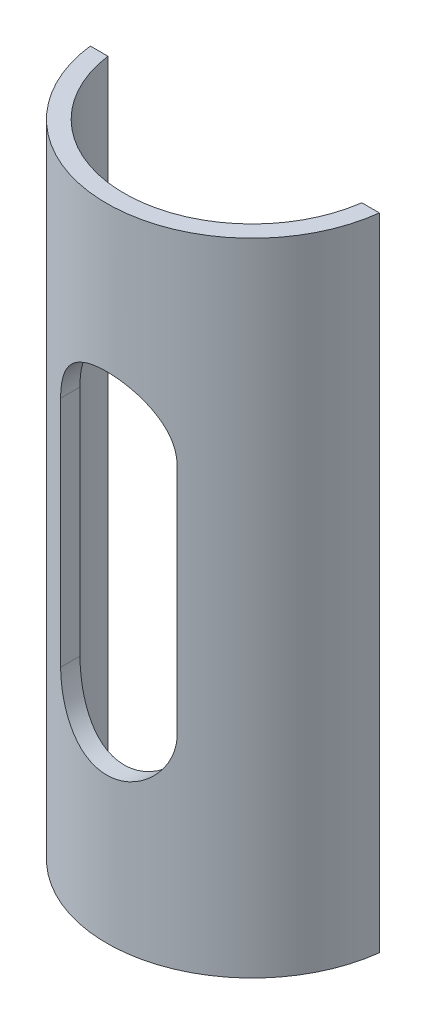
ISO-10303-21;
HEADER;
FILE_DESCRIPTION(('STEP AP214'),'2;1');
FILE_NAME('part.step','',(''),(''),'','','');
FILE_SCHEMA(('AUTOMOTIVE_DESIGN { 1 0 10303 214 1 1 1 1 }'));
ENDSEC;
DATA;
#1=APPLICATION_CONTEXT('core data for automotive mechanical design processes');
#2=APPLICATION_PROTOCOL_DEFINITION('international standard','automotive_design',2000,#1);
#3=PRODUCT_CONTEXT('',#1,'mechanical');
#4=PRODUCT('Part','Part','',(#3));
#5=PRODUCT_RELATED_PRODUCT_CATEGORY('part','',(#4));
#6=PRODUCT_DEFINITION_FORMATION('','',#4);
#7=PRODUCT_DEFINITION_CONTEXT('part definition',#1,'design');
#8=PRODUCT_DEFINITION('design','',#6,#7);
#9=PRODUCT_DEFINITION_SHAPE('','',#8);
#10=(LENGTH_UNIT() NAMED_UNIT(*) SI_UNIT(.MILLI.,.METRE.));
#11=(NAMED_UNIT(*) PLANE_ANGLE_UNIT() SI_UNIT($,.RADIAN.));
#12=(NAMED_UNIT(*) SI_UNIT($,.STERADIAN.) SOLID_ANGLE_UNIT());
#13=UNCERTAINTY_MEASURE_WITH_UNIT(LENGTH_MEASURE(1.E-05),#10,'distance_accuracy_value','');
#14=(GEOMETRIC_REPRESENTATION_CONTEXT(3) GLOBAL_UNCERTAINTY_ASSIGNED_CONTEXT((#13)) GLOBAL_UNIT_ASSIGNED_CONTEXT((#10,
#11,#12)) REPRESENTATION_CONTEXT('',''));
#15=CARTESIAN_POINT('',(0.,0.,0.));
#16=DIRECTION('',(0.,0.,1.));
#17=DIRECTION('',(1.,0.,0.));
#18=AXIS2_PLACEMENT_3D('',#15,#16,#17);
#19=CARTESIAN_POINT('',(0.,55.,0.));
#20=DIRECTION('',(0.,-1.,0.));
#21=DIRECTION('',(0.,0.,-1.));
#22=AXIS2_PLACEMENT_3D('',#19,#20,#21);
#23=CYLINDRICAL_SURFACE('',#22,25.);
#24=CARTESIAN_POINT('',(0.,-55.,0.));
#25=DIRECTION('',(0.,1.,0.));
#26=DIRECTION('',(0.,0.,1.));
#27=AXIS2_PLACEMENT_3D('',#24,#25,#26);
#28=CIRCLE('',#27,25.);
#29=CARTESIAN_POINT('',(-24.8193472919817,-55.,2.99999999999989));
#30=VERTEX_POINT('',#29);
#31=CARTESIAN_POINT('',(24.8193472919817,-55.,3.));
#32=VERTEX_POINT('',#31);
#33=EDGE_CURVE('E165',#30,#32,#28,.T.);
#34=ORIENTED_EDGE('',*,*,#33,.T.);
#35=DIRECTION('',(0.,-1.,0.));
#36=VECTOR('',#35,1.);
#37=CARTESIAN_POINT('',(24.8193472919817,55.,3.));
#38=LINE('',#37,#36);
#39=CARTESIAN_POINT('',(24.8193472919817,55.,3.));
#40=VERTEX_POINT('',#39);
#41=EDGE_CURVE('E168',#40,#32,#38,.T.);
#42=ORIENTED_EDGE('',*,*,#41,.F.);
#43=CARTESIAN_POINT('',(0.,55.,0.));
#44=DIRECTION('',(0.,1.,0.));
#45=DIRECTION('',(0.,0.,1.));
#46=AXIS2_PLACEMENT_3D('',#43,#44,#45);
#47=CIRCLE('',#46,25.);
#48=CARTESIAN_POINT('',(-24.8193472919817,55.,3.));
#49=VERTEX_POINT('',#48);
#50=EDGE_CURVE('E188',#49,#40,#47,.T.);
#51=ORIENTED_EDGE('',*,*,#50,.F.);
#52=DIRECTION('',(0.,-1.,0.));
#53=VECTOR('',#52,1.);
#54=CARTESIAN_POINT('',(-24.8193472919817,55.,3.));
#55=LINE('',#54,#53);
#56=EDGE_CURVE('E170',#49,#30,#55,.T.);
#57=ORIENTED_EDGE('',*,*,#56,.T.);
#58=EDGE_LOOP('',(#34,#42,#51,#57));
#59=FACE_BOUND('',#58,.T.);
#60=CARTESIAN_POINT('',(10.,20.,22.9128784747793));
#61=CARTESIAN_POINT('',(10.0000425292212,20.2690245809977,22.9128218191559));
#62=CARTESIAN_POINT('',(9.98914588174282,20.5380259875444,22.9176145998778));
#63=CARTESIAN_POINT('',(9.94579398570034,21.0738588308298,22.9364819687782));
#64=CARTESIAN_POINT('',(9.91334694801605,21.340691054866,22.9505530218423));
#65=CARTESIAN_POINT('',(9.82738279892872,21.8692294480735,22.9874877521144));
#66=CARTESIAN_POINT('',(9.77394897823352,22.130951639196,23.0103166635897));
#67=CARTESIAN_POINT('',(9.64657237176358,22.6485201405896,23.0640075374184));
#68=CARTESIAN_POINT('',(9.57262833409009,22.9043660911553,23.0948699901146));
#69=CARTESIAN_POINT('',(9.40504471753212,23.4081552469142,23.163620318281));
#70=CARTESIAN_POINT('',(9.31143143100467,23.6561084980248,23.2014988073202));
#71=CARTESIAN_POINT('',(9.10521302674763,24.1430713902433,23.2831998248359));
#72=CARTESIAN_POINT('',(8.99260079382725,24.3820776395322,23.3270245790071));
#73=CARTESIAN_POINT('',(8.74918387125798,24.8498818996507,23.4194092624398));
#74=CARTESIAN_POINT('',(8.61836707465125,25.0786729820151,23.4679723364472));
#75=CARTESIAN_POINT('',(8.33947502508424,25.5247034293787,23.5685197874819));
#76=CARTESIAN_POINT('',(8.19139844343112,25.7419419031577,23.6205044277739));
#77=CARTESIAN_POINT('',(7.87086270262005,26.1745990400814,23.7292985045449));
#78=CARTESIAN_POINT('',(7.69754224009253,26.3893521995864,23.7862186362439));
#79=CARTESIAN_POINT('',(7.33387378202605,26.8036964386267,23.9008501808953));
#80=CARTESIAN_POINT('',(7.14352533784404,27.0032871184137,23.9585616146627));
#81=CARTESIAN_POINT('',(6.74684075907606,27.3862135572747,24.0732791755033));
#82=CARTESIAN_POINT('',(6.54050114821435,27.5695457632852,24.1302851460768));
#83=CARTESIAN_POINT('',(6.1130211003301,27.9187845116563,24.2421075455041));
#84=CARTESIAN_POINT('',(5.89188112636743,28.0846915987808,24.2969240427745));
#85=CARTESIAN_POINT('',(5.42692751085174,28.4042347427254,24.4050744454916));
#86=CARTESIAN_POINT('',(5.18256142515063,28.5571179621335,24.4582621342832));
#87=CARTESIAN_POINT('',(4.68078518183313,28.8415714634338,24.5592285576283));
#88=CARTESIAN_POINT('',(4.42338037412804,28.9731503951586,24.6070094850162));
#89=CARTESIAN_POINT('',(3.89718830978044,29.2138817098203,24.6958112956283));
#90=CARTESIAN_POINT('',(3.62840227939798,29.3230365014487,24.7368329048114));
#91=CARTESIAN_POINT('',(3.08138092491057,29.517844830195,24.8109098223256));
#92=CARTESIAN_POINT('',(2.80314620647427,29.6034998704827,24.8439656401748));
#93=CARTESIAN_POINT('',(2.25305259659716,29.7468244672518,24.8997278381028));
#94=CARTESIAN_POINT('',(1.98153708903728,29.8056480533544,24.9228577626315));
#95=CARTESIAN_POINT('',(1.43395974328178,29.9005535438335,24.9603496461691));
#96=CARTESIAN_POINT('',(1.1578980393189,29.9366361184388,24.9747118635817));
#97=CARTESIAN_POINT('',(0.603485865867567,29.985651068198,24.9942537727212));
#98=CARTESIAN_POINT('',(0.325136106239022,29.9985903699417,24.9994362118753));
#99=CARTESIAN_POINT('',(-0.231685040469908,30.0011913013373,25.0004764570388));
#100=CARTESIAN_POINT('',(-0.510156422931537,29.9908537491245,24.9963345907791));
#101=CARTESIAN_POINT('',(-1.04935303363585,29.9482579111776,24.9793412044512));
#102=CARTESIAN_POINT('',(-1.31019532583514,29.9172654711461,24.9669927456056));
#103=CARTESIAN_POINT('',(-1.82814376456491,29.8349705479487,24.9344183341833));
#104=CARTESIAN_POINT('',(-2.08525007734043,29.7836689713934,24.9141927332472));
#105=CARTESIAN_POINT('',(-2.59399595704992,29.661244413715,24.8663723155126));
#106=CARTESIAN_POINT('',(-2.84563541896429,29.5901210521725,24.838777357282));
#107=CARTESIAN_POINT('',(-3.34183597350712,29.4286906290986,24.7768975627267));
#108=CARTESIAN_POINT('',(-3.58639686633356,29.3383830266653,24.7426125377769));
#109=CARTESIAN_POINT('',(-4.07053474144036,29.1378561287021,24.6676233604634));
#110=CARTESIAN_POINT('',(-4.30998383149299,29.0273611297677,24.6268314667387));
#111=CARTESIAN_POINT('',(-4.77877429805137,28.7882072214097,24.5401744994366));
#112=CARTESIAN_POINT('',(-5.00811200221874,28.6595417828496,24.4943076035603));
#113=CARTESIAN_POINT('',(-5.45537201034554,28.3849735320653,24.398590678047));
#114=CARTESIAN_POINT('',(-5.67329331851291,28.2390692197862,24.3487403019066));
#115=CARTESIAN_POINT('',(-6.09659552601135,27.9309560303126,24.2462153683148));
#116=CARTESIAN_POINT('',(-6.30197550088903,27.7687459535055,24.1935406032068));
#117=CARTESIAN_POINT('',(-6.71219948480528,27.4178120142423,24.0830731073694));
#118=CARTESIAN_POINT('',(-6.91612433249887,27.2280468619223,24.0251713281883));
#119=CARTESIAN_POINT('',(-7.30740755514754,26.8322212948945,23.9090663380437));
#120=CARTESIAN_POINT('',(-7.49476530078337,26.6261602617328,23.8508631157185));
#121=CARTESIAN_POINT('',(-7.85189241580627,26.1988191512717,23.7356906252662));
#122=CARTESIAN_POINT('',(-8.02165335314953,25.9775318615768,23.6787219589608));
#123=CARTESIAN_POINT('',(-8.34239343919931,25.5210755574957,23.5676321076018));
#124=CARTESIAN_POINT('',(-8.49337340236286,25.2859071457318,23.5135107991281));
#125=CARTESIAN_POINT('',(-8.77960393146415,24.79597362151,23.4081715434099));
#126=CARTESIAN_POINT('',(-8.91426828859565,24.540837235855,23.3570840704983));
#127=CARTESIAN_POINT('',(-9.16138202537973,24.0190030514526,23.2612692437556));
#128=CARTESIAN_POINT('',(-9.27384095504852,23.7523102832693,23.2165391580957));
#129=CARTESIAN_POINT('',(-9.47540318672815,23.209431186121,23.1350071385293));
#130=CARTESIAN_POINT('',(-9.56453550922621,22.9332571415496,23.0981953637583));
#131=CARTESIAN_POINT('',(-9.71862079015616,22.3733315118827,23.03378793588));
#132=CARTESIAN_POINT('',(-9.78358458939865,22.0895833855089,23.0061881512999));
#133=CARTESIAN_POINT('',(-9.89048983630447,21.5063726713902,22.960438902214));
#134=CARTESIAN_POINT('',(-9.93152303785059,21.2067112997565,22.9426634565812));
#135=CARTESIAN_POINT('',(-9.9725885894604,20.7552083067592,22.9248264300805));
#136=CARTESIAN_POINT('',(-9.98286305832183,20.6043975524111,22.9203517890329));
#137=CARTESIAN_POINT('',(-9.99656932730846,20.3023998602726,22.9143761097152));
#138=CARTESIAN_POINT('',(-10.0000008141957,20.1512129055789,22.9128752075683));
#139=CARTESIAN_POINT('',(-10.,20.,22.9128784747793));
#140=B_SPLINE_CURVE_WITH_KNOTS('',3,(#60,#61,#62,#63,#64,#65,#66,#67,#68,#69,#70,#71,#72,#73,
#74,#75,#76,#77,#78,#79,#80,#81,#82,#83,#84,#85,#86,#87,#88,#89,#90,#91,#92,#93,#94,#95,#96,#97,
#98,#99,#100,#101,#102,#103,#104,#105,#106,#107,#108,#109,#110,#111,#112,#113,#114,#115,#116,
#117,#118,#119,#120,#121,#122,#123,#124,#125,#126,#127,#128,#129,#130,#131,#132,#133,#134,#135,
#136,#137,#138,#139),.UNSPECIFIED.,.F.,.F.,(4,2,2,2,2,2,2,2,2,2,2,2,2,2,2,2,2,2,2,2,2,2,2,2,2,2,
2,2,2,2,2,2,2,2,2,2,2,2,2,4),(0.,0.806774265545912,1.61324131951602,2.41653955635881,
3.21988683556147,4.02216701628774,4.82474832422576,5.62786596319637,6.43104546865525,
7.27544284011397,8.11986246580439,8.9644661752569,9.8090434718835,10.6872895185795,
11.5651780863052,12.4429723061729,13.3207103645275,14.1559576875845,14.9911803928714,
15.8261530810671,16.6610964220841,17.4490707357659,18.237009877822,19.0249641430297,
19.812940627647,20.6126153443737,21.4125781407159,22.2126105978147,23.0127019563174,
23.8652844903882,24.7178993968256,25.5709209890087,26.423905576093,27.301734000098,
28.1791840651048,29.0555372540353,29.9314968787354,30.8388407270199,31.2923609256799,
31.7459018837827),.UNSPECIFIED.);
#141=CARTESIAN_POINT('',(10.,20.,22.9128784747793));
#142=VERTEX_POINT('',#141);
#143=CARTESIAN_POINT('',(-10.,20.,22.9128784747793));
#144=VERTEX_POINT('',#143);
#145=EDGE_CURVE('E115',#142,#144,#140,.T.);
#146=ORIENTED_EDGE('',*,*,#145,.F.);
#147=DIRECTION('',(0.,-1.,0.));
#148=VECTOR('',#147,1.);
#149=CARTESIAN_POINT('',(10.,55.,22.9128784747793));
#150=LINE('',#149,#148);
#151=CARTESIAN_POINT('',(10.,-20.,22.9128784747793));
#152=VERTEX_POINT('',#151);
#153=EDGE_CURVE('E104',#152,#142,#150,.F.);
#154=ORIENTED_EDGE('',*,*,#153,.F.);
#155=CARTESIAN_POINT('',(-10.,-20.,22.9128784747793));
#156=CARTESIAN_POINT('',(-10.0000425292212,-20.2690245809977,22.912821819156));
#157=CARTESIAN_POINT('',(-9.98914588174281,-20.5380259875443,22.9176145998778));
#158=CARTESIAN_POINT('',(-9.94579398570032,-21.0738588308298,22.9364819687782));
#159=CARTESIAN_POINT('',(-9.91334694801604,-21.340691054866,22.9505530218423));
#160=CARTESIAN_POINT('',(-9.82738279892871,-21.8692294480735,22.9874877521144));
#161=CARTESIAN_POINT('',(-9.77394897823351,-22.130951639196,23.0103166635897));
#162=CARTESIAN_POINT('',(-9.64657237176357,-22.6485201405896,23.0640075374184));
#163=CARTESIAN_POINT('',(-9.57262833409009,-22.9043660911553,23.0948699901146));
#164=CARTESIAN_POINT('',(-9.40504471753211,-23.4081552469142,23.163620318281));
#165=CARTESIAN_POINT('',(-9.31143143100467,-23.6561084980248,23.2014988073203));
#166=CARTESIAN_POINT('',(-9.10521302674763,-24.1430713902433,23.2831998248359));
#167=CARTESIAN_POINT('',(-8.99260079382724,-24.3820776395322,23.3270245790071));
#168=CARTESIAN_POINT('',(-8.74918387125798,-24.8498818996507,23.4194092624398));
#169=CARTESIAN_POINT('',(-8.61836707465125,-25.0786729820151,23.4679723364472));
#170=CARTESIAN_POINT('',(-8.33947502508424,-25.5247034293787,23.5685197874819));
#171=CARTESIAN_POINT('',(-8.19139844343112,-25.7419419031577,23.6205044277739));
#172=CARTESIAN_POINT('',(-7.87086270262005,-26.1745990400814,23.7292985045449));
#173=CARTESIAN_POINT('',(-7.69754224009253,-26.3893521995864,23.7862186362439));
#174=CARTESIAN_POINT('',(-7.33387378202605,-26.8036964386267,23.9008501808953));
#175=CARTESIAN_POINT('',(-7.14352533784405,-27.0032871184137,23.9585616146627));
#176=CARTESIAN_POINT('',(-6.74684075907606,-27.3862135572747,24.0732791755033));
#177=CARTESIAN_POINT('',(-6.54050114821436,-27.5695457632852,24.1302851460768));
#178=CARTESIAN_POINT('',(-6.1130211003301,-27.9187845116563,24.2421075455041));
#179=CARTESIAN_POINT('',(-5.89188112636743,-28.0846915987808,24.2969240427745));
#180=CARTESIAN_POINT('',(-5.42692751085174,-28.4042347427254,24.4050744454916));
#181=CARTESIAN_POINT('',(-5.18256142515064,-28.5571179621335,24.4582621342832));
#182=CARTESIAN_POINT('',(-4.68078518183314,-28.8415714634338,24.5592285576283));
#183=CARTESIAN_POINT('',(-4.42338037412805,-28.9731503951586,24.6070094850162));
#184=CARTESIAN_POINT('',(-3.89718830978045,-29.2138817098204,24.6958112956283));
#185=CARTESIAN_POINT('',(-3.62840227939801,-29.3230365014487,24.7368329048115));
#186=CARTESIAN_POINT('',(-3.08138092491059,-29.517844830195,24.8109098223256));
#187=CARTESIAN_POINT('',(-2.80314620647427,-29.6034998704827,24.8439656401747));
#188=CARTESIAN_POINT('',(-2.25305259659717,-29.7468244672518,24.8997278381026));
#189=CARTESIAN_POINT('',(-1.98153708903729,-29.8056480533544,24.9228577626314));
#190=CARTESIAN_POINT('',(-1.4339597432818,-29.9005535438335,24.9603496461691));
#191=CARTESIAN_POINT('',(-1.15789803931892,-29.9366361184388,24.9747118635817));
#192=CARTESIAN_POINT('',(-0.603485865867582,-29.985651068198,24.9942537727212));
#193=CARTESIAN_POINT('',(-0.325136106239038,-29.9985903699417,24.9994362118753));
#194=CARTESIAN_POINT('',(0.231685040469891,-30.0011913013373,25.0004764570388));
#195=CARTESIAN_POINT('',(0.510156422931521,-29.9908537491245,24.9963345907791));
#196=CARTESIAN_POINT('',(1.04935303363583,-29.9482579111776,24.9793412044512));
#197=CARTESIAN_POINT('',(1.31019532583514,-29.9172654711461,24.9669927456056));
#198=CARTESIAN_POINT('',(1.82814376456491,-29.8349705479487,24.9344183341833));
#199=CARTESIAN_POINT('',(2.08525007734043,-29.7836689713935,24.9141927332472));
#200=CARTESIAN_POINT('',(2.59399595704991,-29.661244413715,24.8663723155126));
#201=CARTESIAN_POINT('',(2.84563541896429,-29.5901210521725,24.838777357282));
#202=CARTESIAN_POINT('',(3.34183597350712,-29.4286906290986,24.7768975627267));
#203=CARTESIAN_POINT('',(3.58639686633355,-29.3383830266654,24.742612537777));
#204=CARTESIAN_POINT('',(4.07053474144036,-29.1378561287021,24.6676233604634));
#205=CARTESIAN_POINT('',(4.309983831493,-29.0273611297678,24.6268314667387));
#206=CARTESIAN_POINT('',(4.77877429805138,-28.7882072214097,24.5401744994366));
#207=CARTESIAN_POINT('',(5.00811200221875,-28.6595417828497,24.4943076035603));
#208=CARTESIAN_POINT('',(5.45537201034555,-28.3849735320653,24.398590678047));
#209=CARTESIAN_POINT('',(5.67329331851293,-28.2390692197862,24.3487403019066));
#210=CARTESIAN_POINT('',(6.09659552601136,-27.9309560303126,24.2462153683148));
#211=CARTESIAN_POINT('',(6.30197550088903,-27.7687459535055,24.1935406032068));
#212=CARTESIAN_POINT('',(6.71219948480529,-27.4178120142423,24.0830731073694));
#213=CARTESIAN_POINT('',(6.91612433249889,-27.2280468619223,24.0251713281883));
#214=CARTESIAN_POINT('',(7.30740755514756,-26.8322212948945,23.9090663380437));
#215=CARTESIAN_POINT('',(7.4947653007834,-26.6261602617329,23.8508631157184));
#216=CARTESIAN_POINT('',(7.85189241580629,-26.1988191512717,23.7356906252662));
#217=CARTESIAN_POINT('',(8.02165335314956,-25.9775318615768,23.6787219589608));
#218=CARTESIAN_POINT('',(8.34239343919933,-25.5210755574957,23.5676321076018));
#219=CARTESIAN_POINT('',(8.49337340236286,-25.2859071457317,23.5135107991281));
#220=CARTESIAN_POINT('',(8.77960393146415,-24.79597362151,23.4081715434099));
#221=CARTESIAN_POINT('',(8.91426828859566,-24.540837235855,23.3570840704983));
#222=CARTESIAN_POINT('',(9.16138202537976,-24.0190030514526,23.2612692437556));
#223=CARTESIAN_POINT('',(9.27384095504855,-23.7523102832693,23.2165391580957));
#224=CARTESIAN_POINT('',(9.47540318672817,-23.209431186121,23.1350071385293));
#225=CARTESIAN_POINT('',(9.56453550922624,-22.9332571415496,23.0981953637582));
#226=CARTESIAN_POINT('',(9.71862079015618,-22.3733315118827,23.03378793588));
#227=CARTESIAN_POINT('',(9.78358458939865,-22.0895833855089,23.0061881512999));
#228=CARTESIAN_POINT('',(9.89048983630448,-21.5063726713902,22.960438902214));
#229=CARTESIAN_POINT('',(9.9315230378506,-21.2067112997565,22.9426634565812));
#230=CARTESIAN_POINT('',(9.97258858946041,-20.7552083067592,22.9248264300805));
#231=CARTESIAN_POINT('',(9.98286305832184,-20.604397552411,22.9203517890329));
#232=CARTESIAN_POINT('',(9.99656932730847,-20.3023998602726,22.9143761097152));
#233=CARTESIAN_POINT('',(10.0000008141957,-20.1512129055789,22.9128752075683));
#234=CARTESIAN_POINT('',(10.,-20.,22.9128784747793));
#235=B_SPLINE_CURVE_WITH_KNOTS('',3,(#155,#156,#157,#158,#159,#160,#161,#162,#163,#164,#165,
#166,#167,#168,#169,#170,#171,#172,#173,#174,#175,#176,#177,#178,#179,#180,#181,#182,#183,#184,
#185,#186,#187,#188,#189,#190,#191,#192,#193,#194,#195,#196,#197,#198,#199,#200,#201,#202,#203,
#204,#205,#206,#207,#208,#209,#210,#211,#212,#213,#214,#215,#216,#217,#218,#219,#220,#221,#222,
#223,#224,#225,#226,#227,#228,#229,#230,#231,#232,#233,#234),.UNSPECIFIED.,.F.,.F.,(4,2,2,2,2,2,
2,2,2,2,2,2,2,2,2,2,2,2,2,2,2,2,2,2,2,2,2,2,2,2,2,2,2,2,2,2,2,2,2,4),(0.,0.806774265545916,
1.61324131951603,2.41653955635882,3.21988683556148,4.02216701628775,4.82474832422577,
5.62786596319638,6.43104546865526,7.27544284011399,8.11986246580441,8.96446617525691,
9.80904347188353,10.6872895185795,11.5651780863052,12.4429723061729,13.3207103645275,
14.1559576875846,14.9911803928714,15.8261530810671,16.6610964220842,17.449070735766,
18.237009877822,19.0249641430297,19.812940627647,20.6126153443737,21.4125781407159,
22.2126105978147,23.0127019563174,23.8652844903882,24.7178993968256,25.5709209890087,
26.423905576093,27.301734000098,28.1791840651048,29.0555372540353,29.9314968787354,
30.8388407270199,31.29236092568,31.7459018837827),.UNSPECIFIED.);
#236=CARTESIAN_POINT('',(-10.,-20.,22.9128784747793));
#237=VERTEX_POINT('',#236);
#238=EDGE_CURVE('E109',#237,#152,#235,.T.);
#239=ORIENTED_EDGE('',*,*,#238,.F.);
#240=DIRECTION('',(0.,-1.,0.));
#241=VECTOR('',#240,1.);
#242=CARTESIAN_POINT('',(-10.,55.,22.9128784747793));
#243=LINE('',#242,#241);
#244=EDGE_CURVE('E120',#144,#237,#243,.T.);
#245=ORIENTED_EDGE('',*,*,#244,.F.);
#246=EDGE_LOOP('',(#146,#154,#239,#245));
#247=FACE_BOUND('',#246,.T.);
#248=ADVANCED_FACE('F37',(#59,#247),#23,.T.);
#249=CARTESIAN_POINT('',(0.,55.,0.));
#250=DIRECTION('',(0.,-1.,0.));
#251=DIRECTION('',(0.,0.,-1.));
#252=AXIS2_PLACEMENT_3D('',#249,#250,#251);
#253=CYLINDRICAL_SURFACE('',#252,22.);
#254=CARTESIAN_POINT('',(0.,-55.,0.));
#255=DIRECTION('',(0.,1.,0.));
#256=DIRECTION('',(0.,0.,1.));
#257=AXIS2_PLACEMENT_3D('',#254,#255,#256);
#258=CIRCLE('',#257,22.);
#259=CARTESIAN_POINT('',(-21.7944947177034,-55.,3.));
#260=VERTEX_POINT('',#259);
#261=CARTESIAN_POINT('',(21.7944947177034,-55.,3.));
#262=VERTEX_POINT('',#261);
#263=EDGE_CURVE('E124',#260,#262,#258,.T.);
#264=ORIENTED_EDGE('',*,*,#263,.F.);
#265=DIRECTION('',(0.,-1.,0.));
#266=VECTOR('',#265,1.);
#267=CARTESIAN_POINT('',(-21.7944947177034,55.,3.));
#268=LINE('',#267,#266);
#269=CARTESIAN_POINT('',(-21.7944947177034,55.,3.));
#270=VERTEX_POINT('',#269);
#271=EDGE_CURVE('E186',#270,#260,#268,.T.);
#272=ORIENTED_EDGE('',*,*,#271,.F.);
#273=CARTESIAN_POINT('',(0.,55.,0.));
#274=DIRECTION('',(0.,1.,0.));
#275=DIRECTION('',(0.,0.,1.));
#276=AXIS2_PLACEMENT_3D('',#273,#274,#275);
#277=CIRCLE('',#276,22.);
#278=CARTESIAN_POINT('',(21.7944947177034,55.,3.));
#279=VERTEX_POINT('',#278);
#280=EDGE_CURVE('E261',#270,#279,#277,.T.);
#281=ORIENTED_EDGE('',*,*,#280,.T.);
#282=DIRECTION('',(0.,-1.,0.));
#283=VECTOR('',#282,1.);
#284=CARTESIAN_POINT('',(21.7944947177034,55.,3.));
#285=LINE('',#284,#283);
#286=EDGE_CURVE('E184',#279,#262,#285,.T.);
#287=ORIENTED_EDGE('',*,*,#286,.T.);
#288=EDGE_LOOP('',(#264,#272,#281,#287));
#289=FACE_BOUND('',#288,.T.);
#290=DIRECTION('',(0.,-1.,0.));
#291=VECTOR('',#290,1.);
#292=CARTESIAN_POINT('',(10.,55.,19.5959179422655));
#293=LINE('',#292,#291);
#294=CARTESIAN_POINT('',(9.99999999999999,-20.,19.5959179422655));
#295=VERTEX_POINT('',#294);
#296=CARTESIAN_POINT('',(10.,20.,19.5959179422655));
#297=VERTEX_POINT('',#296);
#298=EDGE_CURVE('E182',#295,#297,#293,.F.);
#299=ORIENTED_EDGE('',*,*,#298,.T.);
#300=CARTESIAN_POINT('',(10.,20.,19.5959179422655));
#301=CARTESIAN_POINT('',(10.0000459546036,20.265351150792,19.5958501579271));
#302=CARTESIAN_POINT('',(9.98944048956426,20.5306722042692,19.6013054827576));
#303=CARTESIAN_POINT('',(9.9472760367848,21.0590870268256,19.6227602637924));
#304=CARTESIAN_POINT('',(9.91572745068307,21.3221818359343,19.6387544857048));
#305=CARTESIAN_POINT('',(9.83222883850739,21.8429758757271,19.6806837575955));
#306=CARTESIAN_POINT('',(9.78037870970117,22.1006951148795,19.7065701168339));
#307=CARTESIAN_POINT('',(9.65687681061796,22.6102599728371,19.7673845614929));
#308=CARTESIAN_POINT('',(9.58522330863176,22.8621050758882,19.802313437621));
#309=CARTESIAN_POINT('',(9.42299192937907,23.3578429723776,19.8800220980285));
#310=CARTESIAN_POINT('',(9.33244957357005,23.6017497129589,19.9227871279104));
#311=CARTESIAN_POINT('',(9.13316701581743,24.0807631586418,20.0149269274918));
#312=CARTESIAN_POINT('',(9.02441981434717,24.3158664362169,20.064304238061));
#313=CARTESIAN_POINT('',(8.67194683764928,25.0064330783397,20.2203730455085));
#314=CARTESIAN_POINT('',(8.40203254335049,25.4470235240632,20.3349798981406));
#315=CARTESIAN_POINT('',(7.77902158889675,26.3077490156207,20.5816902577711));
#316=CARTESIAN_POINT('',(7.42156690116851,26.7245417293399,20.7144514085254));
#317=CARTESIAN_POINT('',(6.83790834912878,27.301926321201,20.9113703898898));
#318=CARTESIAN_POINT('',(6.63530339493279,27.4865193073655,20.9766791045949));
#319=CARTESIAN_POINT('',(6.21521596801168,27.8387589007364,21.1049576525379));
#320=CARTESIAN_POINT('',(5.99773899649749,28.0064117179215,21.167928337464));
#321=CARTESIAN_POINT('',(5.5369149590269,28.3322534109118,21.2932529363992));
#322=CARTESIAN_POINT('',(5.2928055623392,28.4894479358438,21.3553914221303));
#323=CARTESIAN_POINT('',(4.79070702644916,28.7825749297812,21.4736031244429));
#324=CARTESIAN_POINT('',(4.53271725116231,28.9185064232662,21.5296760627086));
#325=CARTESIAN_POINT('',(4.00465909651419,29.167764754881,21.6341190122001));
#326=CARTESIAN_POINT('',(3.73459567608179,29.281100770957,21.6824921493542));
#327=CARTESIAN_POINT('',(3.18425483042314,29.4840133419992,21.7701200583618));
#328=CARTESIAN_POINT('',(2.90397827890621,29.5735919239558,21.8093756080948));
#329=CARTESIAN_POINT('',(2.3526634360978,29.7232481026871,21.8754961066349));
#330=CARTESIAN_POINT('',(2.08209321873766,29.7847834652514,21.9029673440243));
#331=CARTESIAN_POINT('',(1.53597025398664,29.8852347530504,21.9480259937422));
#332=CARTESIAN_POINT('',(1.26041769110292,29.9241515141396,21.9656137713062));
#333=CARTESIAN_POINT('',(0.70667137222669,29.9788774169754,21.9903933341728));
#334=CARTESIAN_POINT('',(0.428478706899332,29.9946957156773,21.9975892391274));
#335=CARTESIAN_POINT('',(-0.128322594867302,30.003051815217,22.0013869570268));
#336=CARTESIAN_POINT('',(-0.406931210731409,29.9955907317782,21.997989277696));
#337=CARTESIAN_POINT('',(-0.942134934340189,29.9588679837498,21.9813288065582));
#338=CARTESIAN_POINT('',(-1.19886558116072,29.9312210885402,21.9687968356934));
#339=CARTESIAN_POINT('',(-1.70884611017049,29.8562803383879,21.9350209108399));
#340=CARTESIAN_POINT('',(-1.96209619300757,29.8089876209387,21.913777461247));
#341=CARTESIAN_POINT('',(-2.46341367347811,29.695239162701,21.8630984259399));
#342=CARTESIAN_POINT('',(-2.7114809966753,29.6287831468863,21.8336627226531));
#343=CARTESIAN_POINT('',(-3.2008612349238,29.4773470038591,21.7673029700658));
#344=CARTESIAN_POINT('',(-3.44217392926491,29.3923662721395,21.7303786763969));
#345=CARTESIAN_POINT('',(-3.92017117178583,29.2032216084481,21.6492926784389));
#346=CARTESIAN_POINT('',(-4.15673331180365,29.0987908895765,21.6050313992418));
#347=CARTESIAN_POINT('',(-4.62018045345487,28.8724579485664,21.5106940942217));
#348=CARTESIAN_POINT('',(-4.84706196417536,28.7505494917656,21.4606159946365));
#349=CARTESIAN_POINT('',(-5.51133762454949,28.3599516405829,21.3033267089081));
#350=CARTESIAN_POINT('',(-5.93264680787961,28.0662765544342,21.1890103356963));
#351=CARTESIAN_POINT('',(-6.75626789623605,27.3931278423885,20.9416508900975));
#352=CARTESIAN_POINT('',(-7.15423614712878,27.0086136254421,20.8078409130539));
#353=CARTESIAN_POINT('',(-7.69986591918541,26.3865795192071,20.6094578252857));
#354=CARTESIAN_POINT('',(-7.8732930679616,26.1715230802391,20.5436731334649));
#355=CARTESIAN_POINT('',(-8.20214973173149,25.7272221804347,20.4146000086312));
#356=CARTESIAN_POINT('',(-8.35757686943435,25.4979758516375,20.3513119060731));
#357=CARTESIAN_POINT('',(-8.65605118093926,25.0156641103697,20.2262251857816));
#358=CARTESIAN_POINT('',(-8.79819732378045,24.7619878348007,20.1646297336199));
#359=CARTESIAN_POINT('',(-9.06032930087307,24.242068296829,20.0482168058435));
#360=CARTESIAN_POINT('',(-9.18032479398506,23.9758305757763,19.9933963794205));
#361=CARTESIAN_POINT('',(-9.39686269593619,23.4328201270531,19.8925423073307));
#362=CARTESIAN_POINT('',(-9.49344005233504,23.1560638195405,19.8464955906793));
#363=CARTESIAN_POINT('',(-9.6621980567623,22.5938517119205,19.7648857115154));
#364=CARTESIAN_POINT('',(-9.73438948122793,22.3083998154573,19.7293179191304));
#365=CARTESIAN_POINT('',(-9.86213379628529,21.6888593716363,19.6658137253755));
#366=CARTESIAN_POINT('',(-9.91373407522804,21.3537403858209,19.6397422918209));
#367=CARTESIAN_POINT('',(-9.96543564724799,20.8478863965485,19.6135262544712));
#368=CARTESIAN_POINT('',(-9.97838639107056,20.6786834976117,19.6069360497949));
#369=CARTESIAN_POINT('',(-9.9956708111632,20.3396675614707,19.5981278943323));
#370=CARTESIAN_POINT('',(-10.000001568335,20.1698543370799,19.595911424683));
#371=CARTESIAN_POINT('',(-10.,20.,19.5959179422655));
#372=B_SPLINE_CURVE_WITH_KNOTS('',3,(#300,#301,#302,#303,#304,#305,#306,#307,#308,#309,#310,
#311,#312,#313,#314,#315,#316,#317,#318,#319,#320,#321,#322,#323,#324,#325,#326,#327,#328,#329,
#330,#331,#332,#333,#334,#335,#336,#337,#338,#339,#340,#341,#342,#343,#344,#345,#346,#347,#348,
#349,#350,#351,#352,#353,#354,#355,#356,#357,#358,#359,#360,#361,#362,#363,#364,#365,#366,#367,
#368,#369,#370,#371),.UNSPECIFIED.,.F.,.F.,(4,2,2,2,2,2,2,2,2,2,2,2,2,2,2,2,2,2,2,2,2,2,2,2,2,2,
2,2,2,2,2,2,2,2,2,4),(0.,0.795738127972644,1.59108133897605,2.38255913955437,3.17410617294884,
3.9641778673464,4.75455403468665,6.33571655745986,8.02269777335702,8.86722863899357,
9.71144878209916,10.6010858142825,11.4907636499002,12.3800793720669,13.2693191931561,
14.1047201521591,14.9400902375392,15.7751290660064,16.6101278737324,17.3847713726812,
18.1593700260046,18.9339797966954,19.7086148485937,20.4947837654025,21.2812338255709,
22.8532150529717,24.5532577846281,25.4044825565146,26.2558196231457,27.1464033068017,
28.0365977265304,28.9254553927524,29.8139197466154,30.8317357607126,31.3409757355028,
31.8503881315315),.UNSPECIFIED.);
#373=CARTESIAN_POINT('',(-10.,20.,19.5959179422655));
#374=VERTEX_POINT('',#373);
#375=EDGE_CURVE('E11',#297,#374,#372,.T.);
#376=ORIENTED_EDGE('',*,*,#375,.T.);
#377=DIRECTION('',(0.,-1.,0.));
#378=VECTOR('',#377,1.);
#379=CARTESIAN_POINT('',(-10.,55.,19.5959179422655));
#380=LINE('',#379,#378);
#381=CARTESIAN_POINT('',(-9.99999999999999,-20.,19.5959179422655));
#382=VERTEX_POINT('',#381);
#383=EDGE_CURVE('E50',#374,#382,#380,.T.);
#384=ORIENTED_EDGE('',*,*,#383,.T.);
#385=CARTESIAN_POINT('',(-9.99999999999999,-20.,19.5959179422655));
#386=CARTESIAN_POINT('',(-10.0000459546035,-20.265351150792,19.5958501579271));
#387=CARTESIAN_POINT('',(-9.98944048956424,-20.5306722042692,19.6013054827576));
#388=CARTESIAN_POINT('',(-9.94727603678479,-21.0590870268256,19.6227602637924));
#389=CARTESIAN_POINT('',(-9.91572745068305,-21.3221818359343,19.6387544857048));
#390=CARTESIAN_POINT('',(-9.83222883850738,-21.8429758757271,19.6806837575956));
#391=CARTESIAN_POINT('',(-9.78037870970117,-22.1006951148795,19.7065701168339));
#392=CARTESIAN_POINT('',(-9.65687681061796,-22.6102599728371,19.7673845614929));
#393=CARTESIAN_POINT('',(-9.58522330863175,-22.8621050758882,19.8023134376209));
#394=CARTESIAN_POINT('',(-9.42299192937906,-23.3578429723776,19.8800220980284));
#395=CARTESIAN_POINT('',(-9.33244957357004,-23.6017497129589,19.9227871279103));
#396=CARTESIAN_POINT('',(-9.13316701581743,-24.0807631586418,20.0149269274919));
#397=CARTESIAN_POINT('',(-9.02441981434717,-24.3158664362169,20.064304238061));
#398=CARTESIAN_POINT('',(-8.67194683764928,-25.0064330783397,20.2203730455085));
#399=CARTESIAN_POINT('',(-8.40203254335049,-25.4470235240632,20.3349798981406));
#400=CARTESIAN_POINT('',(-7.77902158889675,-26.3077490156207,20.5816902577711));
#401=CARTESIAN_POINT('',(-7.42156690116852,-26.7245417293399,20.7144514085254));
#402=CARTESIAN_POINT('',(-6.8379083491288,-27.3019263212009,20.9113703898898));
#403=CARTESIAN_POINT('',(-6.63530339493282,-27.4865193073655,20.976679104595));
#404=CARTESIAN_POINT('',(-6.21521596801171,-27.8387589007364,21.1049576525379));
#405=CARTESIAN_POINT('',(-5.9977389964975,-28.0064117179215,21.1679283374639));
#406=CARTESIAN_POINT('',(-5.5369149590269,-28.3322534109118,21.2932529363991));
#407=CARTESIAN_POINT('',(-5.29280556233923,-28.4894479358438,21.3553914221302));
#408=CARTESIAN_POINT('',(-4.79070702644919,-28.7825749297812,21.473603124443));
#409=CARTESIAN_POINT('',(-4.53271725116235,-28.9185064232662,21.5296760627086));
#410=CARTESIAN_POINT('',(-4.00465909651422,-29.167764754881,21.6341190122001));
#411=CARTESIAN_POINT('',(-3.73459567608182,-29.2811007709571,21.6824921493542));
#412=CARTESIAN_POINT('',(-3.18425483042316,-29.4840133419992,21.7701200583618));
#413=CARTESIAN_POINT('',(-2.90397827890622,-29.5735919239558,21.8093756080947));
#414=CARTESIAN_POINT('',(-2.35266343609779,-29.7232481026871,21.8754961066348));
#415=CARTESIAN_POINT('',(-2.08209321873767,-29.7847834652514,21.9029673440243));
#416=CARTESIAN_POINT('',(-1.53597025398665,-29.8852347530504,21.9480259937422));
#417=CARTESIAN_POINT('',(-1.26041769110293,-29.9241515141396,21.9656137713062));
#418=CARTESIAN_POINT('',(-0.706671372226697,-29.9788774169754,21.9903933341728));
#419=CARTESIAN_POINT('',(-0.42847870689934,-29.9946957156773,21.9975892391274));
#420=CARTESIAN_POINT('',(0.128322594867295,-30.003051815217,22.0013869570268));
#421=CARTESIAN_POINT('',(0.406931210731405,-29.9955907317782,21.997989277696));
#422=CARTESIAN_POINT('',(0.942134934340188,-29.9588679837498,21.9813288065582));
#423=CARTESIAN_POINT('',(1.19886558116071,-29.9312210885402,21.9687968356934));
#424=CARTESIAN_POINT('',(1.70884611017048,-29.856280338388,21.9350209108399));
#425=CARTESIAN_POINT('',(1.96209619300756,-29.8089876209388,21.913777461247));
#426=CARTESIAN_POINT('',(2.46341367347809,-29.695239162701,21.8630984259399));
#427=CARTESIAN_POINT('',(2.71148099667528,-29.6287831468863,21.833662722653));
#428=CARTESIAN_POINT('',(3.20086123492378,-29.4773470038591,21.7673029700658));
#429=CARTESIAN_POINT('',(3.44217392926489,-29.3923662721395,21.7303786763971));
#430=CARTESIAN_POINT('',(3.92017117178581,-29.2032216084481,21.649292678439));
#431=CARTESIAN_POINT('',(4.15673331180364,-29.0987908895765,21.6050313992418));
#432=CARTESIAN_POINT('',(4.62018045345486,-28.8724579485664,21.5106940942216));
#433=CARTESIAN_POINT('',(4.84706196417536,-28.7505494917656,21.4606159946365));
#434=CARTESIAN_POINT('',(5.51133762454949,-28.359951640583,21.3033267089082));
#435=CARTESIAN_POINT('',(5.9326468078796,-28.0662765544342,21.1890103356963));
#436=CARTESIAN_POINT('',(6.75626789623604,-27.3931278423885,20.9416508900975));
#437=CARTESIAN_POINT('',(7.15423614712879,-27.0086136254422,20.8078409130539));
#438=CARTESIAN_POINT('',(7.69986591918544,-26.3865795192071,20.6094578252857));
#439=CARTESIAN_POINT('',(7.87329306796163,-26.1715230802391,20.5436731334649));
#440=CARTESIAN_POINT('',(8.2021497317315,-25.7272221804347,20.4146000086312));
#441=CARTESIAN_POINT('',(8.35757686943435,-25.4979758516376,20.351311906073));
#442=CARTESIAN_POINT('',(8.65605118093925,-25.0156641103697,20.2262251857815));
#443=CARTESIAN_POINT('',(8.79819732378046,-24.7619878348007,20.1646297336199));
#444=CARTESIAN_POINT('',(9.0603293008731,-24.242068296829,20.0482168058436));
#445=CARTESIAN_POINT('',(9.18032479398508,-23.9758305757763,19.9933963794205));
#446=CARTESIAN_POINT('',(9.3968626959362,-23.4328201270531,19.8925423073307));
#447=CARTESIAN_POINT('',(9.49344005233506,-23.1560638195405,19.8464955906793));
#448=CARTESIAN_POINT('',(9.66219805676231,-22.5938517119205,19.7648857115153));
#449=CARTESIAN_POINT('',(9.73438948122793,-22.3083998154573,19.7293179191304));
#450=CARTESIAN_POINT('',(9.86213379628529,-21.6888593716363,19.6658137253755));
#451=CARTESIAN_POINT('',(9.91373407522804,-21.3537403858209,19.6397422918209));
#452=CARTESIAN_POINT('',(9.965435647248,-20.8478863965485,19.6135262544712));
#453=CARTESIAN_POINT('',(9.97838639107057,-20.6786834976118,19.6069360497949));
#454=CARTESIAN_POINT('',(9.99567081116321,-20.3396675614707,19.5981278943323));
#455=CARTESIAN_POINT('',(10.000001568335,-20.1698543370799,19.595911424683));
#456=CARTESIAN_POINT('',(9.99999999999999,-20.,19.5959179422655));
#457=B_SPLINE_CURVE_WITH_KNOTS('',3,(#385,#386,#387,#388,#389,#390,#391,#392,#393,#394,#395,
#396,#397,#398,#399,#400,#401,#402,#403,#404,#405,#406,#407,#408,#409,#410,#411,#412,#413,#414,
#415,#416,#417,#418,#419,#420,#421,#422,#423,#424,#425,#426,#427,#428,#429,#430,#431,#432,#433,
#434,#435,#436,#437,#438,#439,#440,#441,#442,#443,#444,#445,#446,#447,#448,#449,#450,#451,#452,
#453,#454,#455,#456),.UNSPECIFIED.,.F.,.F.,(4,2,2,2,2,2,2,2,2,2,2,2,2,2,2,2,2,2,2,2,2,2,2,2,2,2,
2,2,2,2,2,2,2,2,2,4),(0.,0.795738127972631,1.59108133897604,2.38255913955435,3.17410617294881,
3.96417786734637,4.75455403468663,6.33571655745984,8.02269777335698,8.86722863899352,
9.71144878209911,10.6010858142825,11.4907636499001,12.3800793720669,13.269319193156,
14.1047201521591,14.9400902375392,15.7751290660064,16.6101278737324,17.3847713726811,
18.1593700260046,18.9339797966954,19.7086148485936,20.4947837654025,21.2812338255709,
22.8532150529717,24.5532577846281,25.4044825565146,26.2558196231458,27.1464033068018,
28.0365977265304,28.9254553927524,29.8139197466154,30.8317357607126,31.3409757355028,
31.8503881315315),.UNSPECIFIED.);
#458=EDGE_CURVE('E190',#382,#295,#457,.T.);
#459=ORIENTED_EDGE('',*,*,#458,.T.);
#460=EDGE_LOOP('',(#299,#376,#384,#459));
#461=FACE_BOUND('',#460,.T.);
#462=ADVANCED_FACE('F156',(#289,#461),#253,.F.);
#463=CARTESIAN_POINT('',(-24.8193472919817,55.,3.));
#464=DIRECTION('',(0.,0.,-1.));
#465=DIRECTION('',(-1.,0.,0.));
#466=AXIS2_PLACEMENT_3D('',#463,#464,#465);
#467=PLANE('',#466);
#468=DIRECTION('',(1.,0.,0.));
#469=VECTOR('',#468,1.);
#470=CARTESIAN_POINT('',(-24.8193472919817,-55.,3.));
#471=LINE('',#470,#469);
#472=EDGE_CURVE('E121',#30,#260,#471,.T.);
#473=ORIENTED_EDGE('',*,*,#472,.F.);
#474=ORIENTED_EDGE('',*,*,#56,.F.);
#475=DIRECTION('',(1.,0.,0.));
#476=VECTOR('',#475,1.);
#477=CARTESIAN_POINT('',(-24.8193472919817,55.,3.));
#478=LINE('',#477,#476);
#479=EDGE_CURVE('E134',#49,#270,#478,.T.);
#480=ORIENTED_EDGE('',*,*,#479,.T.);
#481=ORIENTED_EDGE('',*,*,#271,.T.);
#482=EDGE_LOOP('',(#473,#474,#480,#481));
#483=FACE_BOUND('',#482,.T.);
#484=ADVANCED_FACE('F39',(#483),#467,.T.);
#485=CARTESIAN_POINT('',(21.7944947177034,55.,3.));
#486=DIRECTION('',(0.,0.,-1.));
#487=DIRECTION('',(-1.,0.,0.));
#488=AXIS2_PLACEMENT_3D('',#485,#486,#487);
#489=PLANE('',#488);
#490=DIRECTION('',(1.,0.,0.));
#491=VECTOR('',#490,1.);
#492=CARTESIAN_POINT('',(21.7944947177034,-55.,3.));
#493=LINE('',#492,#491);
#494=EDGE_CURVE('E172',#262,#32,#493,.T.);
#495=ORIENTED_EDGE('',*,*,#494,.F.);
#496=ORIENTED_EDGE('',*,*,#286,.F.);
#497=DIRECTION('',(1.,0.,0.));
#498=VECTOR('',#497,1.);
#499=CARTESIAN_POINT('',(21.7944947177034,55.,3.));
#500=LINE('',#499,#498);
#501=EDGE_CURVE('E263',#279,#40,#500,.T.);
#502=ORIENTED_EDGE('',*,*,#501,.T.);
#503=ORIENTED_EDGE('',*,*,#41,.T.);
#504=EDGE_LOOP('',(#495,#496,#502,#503));
#505=FACE_BOUND('',#504,.T.);
#506=ADVANCED_FACE('F149',(#505),#489,.T.);
#507=CARTESIAN_POINT('',(0.,55.,0.));
#508=DIRECTION('',(0.,1.,0.));
#509=DIRECTION('',(0.,0.,1.));
#510=AXIS2_PLACEMENT_3D('',#507,#508,#509);
#511=PLANE('',#510);
#512=ORIENTED_EDGE('',*,*,#479,.F.);
#513=ORIENTED_EDGE('',*,*,#50,.T.);
#514=ORIENTED_EDGE('',*,*,#501,.F.);
#515=ORIENTED_EDGE('',*,*,#280,.F.);
#516=EDGE_LOOP('',(#512,#513,#514,#515));
#517=FACE_BOUND('',#516,.T.);
#518=ADVANCED_FACE('F146',(#517),#511,.T.);
#519=CARTESIAN_POINT('',(0.,-55.,0.));
#520=DIRECTION('',(0.,1.,0.));
#521=DIRECTION('',(0.,0.,1.));
#522=AXIS2_PLACEMENT_3D('',#519,#520,#521);
#523=PLANE('',#522);
#524=ORIENTED_EDGE('',*,*,#472,.T.);
#525=ORIENTED_EDGE('',*,*,#263,.T.);
#526=ORIENTED_EDGE('',*,*,#494,.T.);
#527=ORIENTED_EDGE('',*,*,#33,.F.);
#528=EDGE_LOOP('',(#524,#525,#526,#527));
#529=FACE_BOUND('',#528,.T.);
#530=ADVANCED_FACE('F144',(#529),#523,.F.);
#531=CARTESIAN_POINT('',(0.,20.,80.));
#532=DIRECTION('',(0.,0.,-1.));
#533=DIRECTION('',(-1.,0.,0.));
#534=AXIS2_PLACEMENT_3D('',#531,#532,#533);
#535=CYLINDRICAL_SURFACE('',#534,10.);
#536=ORIENTED_EDGE('',*,*,#145,.T.);
#537=DIRECTION('',(0.,0.,-1.));
#538=VECTOR('',#537,1.);
#539=CARTESIAN_POINT('',(-9.99999999999999,20.,80.));
#540=LINE('',#539,#538);
#541=EDGE_CURVE('E110',#144,#374,#540,.T.);
#542=ORIENTED_EDGE('',*,*,#541,.T.);
#543=ORIENTED_EDGE('',*,*,#375,.F.);
#544=DIRECTION('',(0.,0.,-1.));
#545=VECTOR('',#544,1.);
#546=CARTESIAN_POINT('',(10.,20.,80.0000000000002));
#547=LINE('',#546,#545);
#548=EDGE_CURVE('E62',#142,#297,#547,.T.);
#549=ORIENTED_EDGE('',*,*,#548,.F.);
#550=EDGE_LOOP('',(#536,#542,#543,#549));
#551=FACE_BOUND('',#550,.T.);
#552=ADVANCED_FACE('F113',(#551),#535,.F.);
#553=CARTESIAN_POINT('',(-9.99999999999999,-20.,80.));
#554=DIRECTION('',(1.,0.,0.));
#555=DIRECTION('',(0.,1.,0.));
#556=AXIS2_PLACEMENT_3D('',#553,#554,#555);
#557=PLANE('',#556);
#558=ORIENTED_EDGE('',*,*,#244,.T.);
#559=DIRECTION('',(0.,0.,-1.));
#560=VECTOR('',#559,1.);
#561=CARTESIAN_POINT('',(-9.99999999999999,-20.,80.));
#562=LINE('',#561,#560);
#563=EDGE_CURVE('E209',#237,#382,#562,.T.);
#564=ORIENTED_EDGE('',*,*,#563,.T.);
#565=ORIENTED_EDGE('',*,*,#383,.F.);
#566=ORIENTED_EDGE('',*,*,#541,.F.);
#567=EDGE_LOOP('',(#558,#564,#565,#566));
#568=FACE_BOUND('',#567,.T.);
#569=ADVANCED_FACE('F143',(#568),#557,.T.);
#570=CARTESIAN_POINT('',(0.,-20.,80.));
#571=DIRECTION('',(0.,0.,-1.));
#572=DIRECTION('',(-1.,0.,0.));
#573=AXIS2_PLACEMENT_3D('',#570,#571,#572);
#574=CYLINDRICAL_SURFACE('',#573,10.);
#575=ORIENTED_EDGE('',*,*,#238,.T.);
#576=DIRECTION('',(0.,0.,-1.));
#577=VECTOR('',#576,1.);
#578=CARTESIAN_POINT('',(10.,-20.,80.));
#579=LINE('',#578,#577);
#580=EDGE_CURVE('E57',#152,#295,#579,.T.);
#581=ORIENTED_EDGE('',*,*,#580,.T.);
#582=ORIENTED_EDGE('',*,*,#458,.F.);
#583=ORIENTED_EDGE('',*,*,#563,.F.);
#584=EDGE_LOOP('',(#575,#581,#582,#583));
#585=FACE_BOUND('',#584,.T.);
#586=ADVANCED_FACE('F197',(#585),#574,.F.);
#587=CARTESIAN_POINT('',(10.,-20.,80.));
#588=DIRECTION('',(-1.,0.,0.));
#589=DIRECTION('',(0.,-1.,0.));
#590=AXIS2_PLACEMENT_3D('',#587,#588,#589);
#591=PLANE('',#590);
#592=ORIENTED_EDGE('',*,*,#153,.T.);
#593=ORIENTED_EDGE('',*,*,#548,.T.);
#594=ORIENTED_EDGE('',*,*,#298,.F.);
#595=ORIENTED_EDGE('',*,*,#580,.F.);
#596=EDGE_LOOP('',(#592,#593,#594,#595));
#597=FACE_BOUND('',#596,.T.);
#598=ADVANCED_FACE('F105',(#597),#591,.T.);
#599=CLOSED_SHELL('',(#248,#462,#484,#506,#518,#530,#552,#569,#586,#598));
#600=MANIFOLD_SOLID_BREP('B2',#599);
#601=ADVANCED_BREP_SHAPE_REPRESENTATION('',(#18,#600),#14);
#602=SHAPE_DEFINITION_REPRESENTATION(#9,#601);
ENDSEC;
END-ISO-10303-21;
